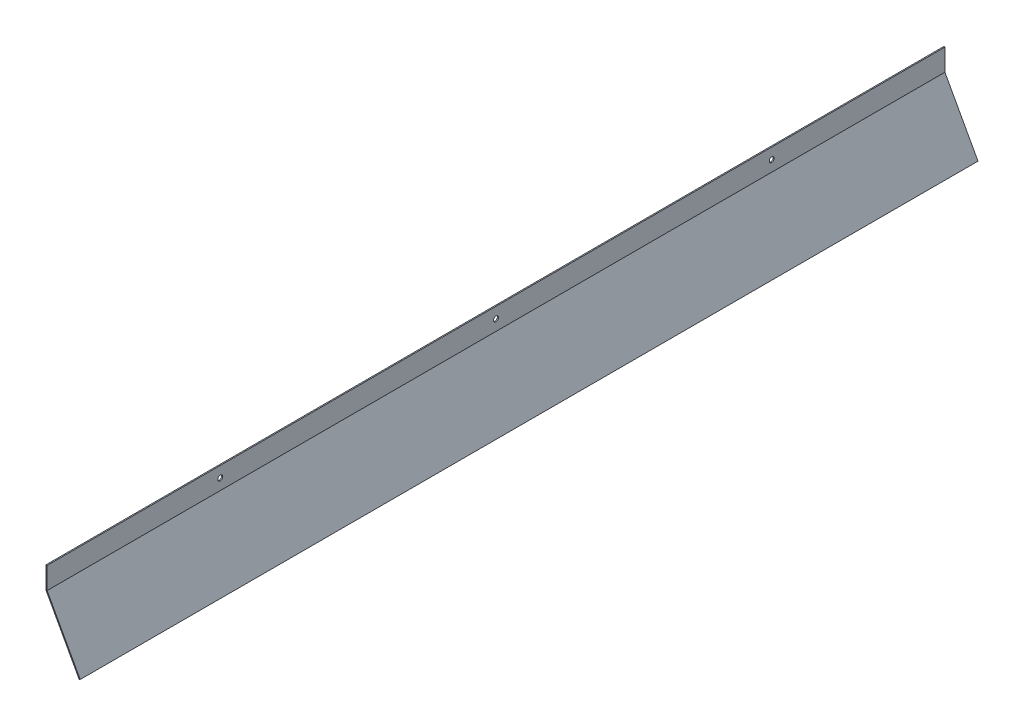
ISO-10303-21;
HEADER;
FILE_DESCRIPTION(('STEP AP214'),'2;1');
FILE_NAME('part.step','',(''),(''),'','','');
FILE_SCHEMA(('AUTOMOTIVE_DESIGN { 1 0 10303 214 1 1 1 1 }'));
ENDSEC;
DATA;
#1=APPLICATION_CONTEXT('core data for automotive mechanical design processes');
#2=APPLICATION_PROTOCOL_DEFINITION('international standard','automotive_design',2000,#1);
#3=PRODUCT_CONTEXT('',#1,'mechanical');
#4=PRODUCT('Part','Part','',(#3));
#5=PRODUCT_RELATED_PRODUCT_CATEGORY('part','',(#4));
#6=PRODUCT_DEFINITION_FORMATION('','',#4);
#7=PRODUCT_DEFINITION_CONTEXT('part definition',#1,'design');
#8=PRODUCT_DEFINITION('design','',#6,#7);
#9=PRODUCT_DEFINITION_SHAPE('','',#8);
#10=(LENGTH_UNIT() NAMED_UNIT(*) SI_UNIT(.MILLI.,.METRE.));
#11=(NAMED_UNIT(*) PLANE_ANGLE_UNIT() SI_UNIT($,.RADIAN.));
#12=(NAMED_UNIT(*) SI_UNIT($,.STERADIAN.) SOLID_ANGLE_UNIT());
#13=UNCERTAINTY_MEASURE_WITH_UNIT(LENGTH_MEASURE(1.E-05),#10,'distance_accuracy_value','');
#14=(GEOMETRIC_REPRESENTATION_CONTEXT(3) GLOBAL_UNCERTAINTY_ASSIGNED_CONTEXT((#13)) GLOBAL_UNIT_ASSIGNED_CONTEXT((#10,
#11,#12)) REPRESENTATION_CONTEXT('',''));
#15=CARTESIAN_POINT('',(0.,0.,0.));
#16=DIRECTION('',(0.,0.,1.));
#17=DIRECTION('',(1.,0.,0.));
#18=AXIS2_PLACEMENT_3D('',#15,#16,#17);
#19=CARTESIAN_POINT('',(0.,0.,-1628.));
#20=DIRECTION('',(1.,0.,0.));
#21=DIRECTION('',(0.,0.,-1.));
#22=AXIS2_PLACEMENT_3D('',#19,#20,#21);
#23=PLANE('',#22);
#24=CARTESIAN_POINT('',(0.,19.7443093499552,-314.));
#25=DIRECTION('',(1.,0.,0.));
#26=DIRECTION('',(0.,0.,-1.));
#27=AXIS2_PLACEMENT_3D('',#24,#25,#26);
#28=CIRCLE('',#27,4.4999999999999);
#29=CARTESIAN_POINT('',(0.,19.7443093499552,-318.5));
#30=VERTEX_POINT('',#29);
#31=EDGE_CURVE('E189',#30,#30,#28,.T.);
#32=ORIENTED_EDGE('',*,*,#31,.F.);
#33=EDGE_LOOP('',(#32));
#34=FACE_BOUND('',#33,.T.);
#35=CARTESIAN_POINT('',(0.,19.7443093499553,-1314.));
#36=DIRECTION('',(1.,0.,0.));
#37=DIRECTION('',(0.,0.,1.));
#38=AXIS2_PLACEMENT_3D('',#35,#36,#37);
#39=CIRCLE('',#38,4.50000000000001);
#40=CARTESIAN_POINT('',(0.,19.7443093499553,-1309.5));
#41=VERTEX_POINT('',#40);
#42=EDGE_CURVE('E195',#41,#41,#39,.T.);
#43=ORIENTED_EDGE('',*,*,#42,.F.);
#44=EDGE_LOOP('',(#43));
#45=FACE_BOUND('',#44,.T.);
#46=CARTESIAN_POINT('',(0.,19.7443093499552,-814.));
#47=DIRECTION('',(1.,0.,0.));
#48=DIRECTION('',(0.,0.,-1.));
#49=AXIS2_PLACEMENT_3D('',#46,#47,#48);
#50=CIRCLE('',#49,4.49999999999991);
#51=CARTESIAN_POINT('',(0.,19.7443093499552,-818.5));
#52=VERTEX_POINT('',#51);
#53=EDGE_CURVE('E192',#52,#52,#50,.T.);
#54=ORIENTED_EDGE('',*,*,#53,.F.);
#55=EDGE_LOOP('',(#54));
#56=FACE_BOUND('',#55,.T.);
#57=DIRECTION('',(0.,1.,0.));
#58=VECTOR('',#57,1.);
#59=CARTESIAN_POINT('',(0.,0.,0.));
#60=LINE('',#59,#58);
#61=CARTESIAN_POINT('',(0.,0.,0.));
#62=VERTEX_POINT('',#61);
#63=CARTESIAN_POINT('',(0.,39.4886186999102,0.));
#64=VERTEX_POINT('',#63);
#65=EDGE_CURVE('E122',#62,#64,#60,.T.);
#66=ORIENTED_EDGE('',*,*,#65,.F.);
#67=DIRECTION('',(0.,0.,1.));
#68=VECTOR('',#67,1.);
#69=CARTESIAN_POINT('',(0.,0.,-1628.));
#70=LINE('',#69,#68);
#71=CARTESIAN_POINT('',(0.,0.,-1628.));
#72=VERTEX_POINT('',#71);
#73=EDGE_CURVE('E11',#72,#62,#70,.T.);
#74=ORIENTED_EDGE('',*,*,#73,.F.);
#75=DIRECTION('',(0.,1.,0.));
#76=VECTOR('',#75,1.);
#77=CARTESIAN_POINT('',(0.,0.,-1628.));
#78=LINE('',#77,#76);
#79=CARTESIAN_POINT('',(0.,39.4886186999102,-1628.));
#80=VERTEX_POINT('',#79);
#81=EDGE_CURVE('E137',#72,#80,#78,.T.);
#82=ORIENTED_EDGE('',*,*,#81,.T.);
#83=DIRECTION('',(0.,0.,1.));
#84=VECTOR('',#83,1.);
#85=CARTESIAN_POINT('',(0.,39.4886186999102,-1628.));
#86=LINE('',#85,#84);
#87=EDGE_CURVE('E40',#80,#64,#86,.T.);
#88=ORIENTED_EDGE('',*,*,#87,.T.);
#89=EDGE_LOOP('',(#66,#74,#82,#88));
#90=FACE_BOUND('',#89,.T.);
#91=ADVANCED_FACE('F37',(#34,#45,#56,#90),#23,.T.);
#92=CARTESIAN_POINT('',(0.,0.,-1628.));
#93=DIRECTION('',(0.877268487978452,0.48,0.));
#94=DIRECTION('',(-0.48,0.877268487978452,0.));
#95=AXIS2_PLACEMENT_3D('',#92,#93,#94);
#96=PLANE('',#95);
#97=DIRECTION('',(-0.48,0.877268487978452,0.));
#98=VECTOR('',#97,1.);
#99=CARTESIAN_POINT('',(0.,0.,0.));
#100=LINE('',#99,#98);
#101=CARTESIAN_POINT('',(60.,-109.658560997307,0.));
#102=VERTEX_POINT('',#101);
#103=EDGE_CURVE('E135',#102,#62,#100,.T.);
#104=ORIENTED_EDGE('',*,*,#103,.F.);
#105=DIRECTION('',(0.,0.,1.));
#106=VECTOR('',#105,1.);
#107=CARTESIAN_POINT('',(60.,-109.658560997307,-1628.));
#108=LINE('',#107,#106);
#109=CARTESIAN_POINT('',(60.,-109.658560997307,-1628.));
#110=VERTEX_POINT('',#109);
#111=EDGE_CURVE('E46',#110,#102,#108,.T.);
#112=ORIENTED_EDGE('',*,*,#111,.F.);
#113=DIRECTION('',(-0.48,0.877268487978452,0.));
#114=VECTOR('',#113,1.);
#115=CARTESIAN_POINT('',(0.,0.,-1628.));
#116=LINE('',#115,#114);
#117=EDGE_CURVE('E112',#110,#72,#116,.T.);
#118=ORIENTED_EDGE('',*,*,#117,.T.);
#119=ORIENTED_EDGE('',*,*,#73,.T.);
#120=EDGE_LOOP('',(#104,#112,#118,#119));
#121=FACE_BOUND('',#120,.T.);
#122=ADVANCED_FACE('F145',(#121),#96,.T.);
#123=CARTESIAN_POINT('',(58.2454630240431,-110.618560997307,-1628.));
#124=DIRECTION('',(0.480000000000009,-0.877268487978447,0.));
#125=DIRECTION('',(0.877268487978448,0.480000000000009,0.));
#126=AXIS2_PLACEMENT_3D('',#123,#124,#125);
#127=PLANE('',#126);
#128=DIRECTION('',(0.877268487978448,0.480000000000009,0.));
#129=VECTOR('',#128,1.);
#130=CARTESIAN_POINT('',(58.2454630240431,-110.618560997307,0.));
#131=LINE('',#130,#129);
#132=CARTESIAN_POINT('',(58.2454630240431,-110.618560997307,0.));
#133=VERTEX_POINT('',#132);
#134=EDGE_CURVE('E99',#133,#102,#131,.T.);
#135=ORIENTED_EDGE('',*,*,#134,.F.);
#136=DIRECTION('',(0.,0.,1.));
#137=VECTOR('',#136,1.);
#138=CARTESIAN_POINT('',(58.2454630240431,-110.618560997307,-1628.));
#139=LINE('',#138,#137);
#140=CARTESIAN_POINT('',(58.2454630240431,-110.618560997307,-1628.));
#141=VERTEX_POINT('',#140);
#142=EDGE_CURVE('E94',#141,#133,#139,.T.);
#143=ORIENTED_EDGE('',*,*,#142,.F.);
#144=DIRECTION('',(0.877268487978448,0.480000000000009,0.));
#145=VECTOR('',#144,1.);
#146=CARTESIAN_POINT('',(58.2454630240431,-110.618560997307,-1628.));
#147=LINE('',#146,#145);
#148=EDGE_CURVE('E97',#141,#110,#147,.T.);
#149=ORIENTED_EDGE('',*,*,#148,.T.);
#150=ORIENTED_EDGE('',*,*,#111,.T.);
#151=EDGE_LOOP('',(#135,#143,#149,#150));
#152=FACE_BOUND('',#151,.T.);
#153=ADVANCED_FACE('F96',(#152),#127,.T.);
#154=CARTESIAN_POINT('',(-2.,-0.511381300089771,-1628.));
#155=DIRECTION('',(-0.877268487978452,-0.48,0.));
#156=DIRECTION('',(0.48,-0.877268487978452,0.));
#157=AXIS2_PLACEMENT_3D('',#154,#155,#156);
#158=PLANE('',#157);
#159=DIRECTION('',(0.48,-0.877268487978452,0.));
#160=VECTOR('',#159,1.);
#161=CARTESIAN_POINT('',(-2.,-0.511381300089771,0.));
#162=LINE('',#161,#160);
#163=CARTESIAN_POINT('',(-2.,-0.511381300089771,0.));
#164=VERTEX_POINT('',#163);
#165=EDGE_CURVE('E132',#164,#133,#162,.T.);
#166=ORIENTED_EDGE('',*,*,#165,.F.);
#167=DIRECTION('',(0.,0.,1.));
#168=VECTOR('',#167,1.);
#169=CARTESIAN_POINT('',(-2.,-0.511381300089771,-1628.));
#170=LINE('',#169,#168);
#171=CARTESIAN_POINT('',(-2.,-0.511381300089771,-1628.));
#172=VERTEX_POINT('',#171);
#173=EDGE_CURVE('E104',#172,#164,#170,.T.);
#174=ORIENTED_EDGE('',*,*,#173,.F.);
#175=DIRECTION('',(0.48,-0.877268487978452,0.));
#176=VECTOR('',#175,1.);
#177=CARTESIAN_POINT('',(-2.,-0.511381300089771,-1628.));
#178=LINE('',#177,#176);
#179=EDGE_CURVE('E110',#172,#141,#178,.T.);
#180=ORIENTED_EDGE('',*,*,#179,.T.);
#181=ORIENTED_EDGE('',*,*,#142,.T.);
#182=EDGE_LOOP('',(#166,#174,#180,#181));
#183=FACE_BOUND('',#182,.T.);
#184=ADVANCED_FACE('F114',(#183),#158,.T.);
#185=CARTESIAN_POINT('',(-2.,-0.511381300089771,-1628.));
#186=DIRECTION('',(-1.,0.,0.));
#187=DIRECTION('',(0.,0.,1.));
#188=AXIS2_PLACEMENT_3D('',#185,#186,#187);
#189=PLANE('',#188);
#190=CARTESIAN_POINT('',(-2.,19.7443093499552,-314.));
#191=DIRECTION('',(1.,0.,0.));
#192=DIRECTION('',(0.,0.,-1.));
#193=AXIS2_PLACEMENT_3D('',#190,#191,#192);
#194=CIRCLE('',#193,4.4999999999999);
#195=CARTESIAN_POINT('',(-2.,19.7443093499552,-318.5));
#196=VERTEX_POINT('',#195);
#197=EDGE_CURVE('E186',#196,#196,#194,.T.);
#198=ORIENTED_EDGE('',*,*,#197,.T.);
#199=EDGE_LOOP('',(#198));
#200=FACE_BOUND('',#199,.T.);
#201=CARTESIAN_POINT('',(-2.,19.7443093499553,-1314.));
#202=DIRECTION('',(1.,0.,0.));
#203=DIRECTION('',(0.,0.,1.));
#204=AXIS2_PLACEMENT_3D('',#201,#202,#203);
#205=CIRCLE('',#204,4.50000000000001);
#206=CARTESIAN_POINT('',(-2.,19.7443093499553,-1309.5));
#207=VERTEX_POINT('',#206);
#208=EDGE_CURVE('E190',#207,#207,#205,.T.);
#209=ORIENTED_EDGE('',*,*,#208,.T.);
#210=EDGE_LOOP('',(#209));
#211=FACE_BOUND('',#210,.T.);
#212=CARTESIAN_POINT('',(-2.,19.7443093499552,-814.));
#213=DIRECTION('',(1.,0.,0.));
#214=DIRECTION('',(0.,0.,-1.));
#215=AXIS2_PLACEMENT_3D('',#212,#213,#214);
#216=CIRCLE('',#215,4.49999999999991);
#217=CARTESIAN_POINT('',(-2.,19.7443093499552,-818.5));
#218=VERTEX_POINT('',#217);
#219=EDGE_CURVE('E126',#218,#218,#216,.T.);
#220=ORIENTED_EDGE('',*,*,#219,.T.);
#221=EDGE_LOOP('',(#220));
#222=FACE_BOUND('',#221,.T.);
#223=DIRECTION('',(0.,-1.,0.));
#224=VECTOR('',#223,1.);
#225=CARTESIAN_POINT('',(-2.,-0.511381300089771,0.));
#226=LINE('',#225,#224);
#227=CARTESIAN_POINT('',(-2.,39.4886186999102,0.));
#228=VERTEX_POINT('',#227);
#229=EDGE_CURVE('E129',#228,#164,#226,.T.);
#230=ORIENTED_EDGE('',*,*,#229,.F.);
#231=DIRECTION('',(0.,0.,1.));
#232=VECTOR('',#231,1.);
#233=CARTESIAN_POINT('',(-2.,39.4886186999102,-1628.));
#234=LINE('',#233,#232);
#235=CARTESIAN_POINT('',(-2.,39.4886186999102,-1628.));
#236=VERTEX_POINT('',#235);
#237=EDGE_CURVE('E140',#236,#228,#234,.T.);
#238=ORIENTED_EDGE('',*,*,#237,.F.);
#239=DIRECTION('',(0.,-1.,0.));
#240=VECTOR('',#239,1.);
#241=CARTESIAN_POINT('',(-2.,-0.511381300089771,-1628.));
#242=LINE('',#241,#240);
#243=EDGE_CURVE('E115',#236,#172,#242,.T.);
#244=ORIENTED_EDGE('',*,*,#243,.T.);
#245=ORIENTED_EDGE('',*,*,#173,.T.);
#246=EDGE_LOOP('',(#230,#238,#244,#245));
#247=FACE_BOUND('',#246,.T.);
#248=ADVANCED_FACE('F159',(#200,#211,#222,#247),#189,.T.);
#249=CARTESIAN_POINT('',(0.,39.4886186999102,-1628.));
#250=DIRECTION('',(0.,1.,0.));
#251=DIRECTION('',(-1.,0.,0.));
#252=AXIS2_PLACEMENT_3D('',#249,#250,#251);
#253=PLANE('',#252);
#254=DIRECTION('',(-1.,0.,0.));
#255=VECTOR('',#254,1.);
#256=CARTESIAN_POINT('',(0.,39.4886186999102,0.));
#257=LINE('',#256,#255);
#258=EDGE_CURVE('E125',#64,#228,#257,.T.);
#259=ORIENTED_EDGE('',*,*,#258,.F.);
#260=ORIENTED_EDGE('',*,*,#87,.F.);
#261=DIRECTION('',(-1.,0.,0.));
#262=VECTOR('',#261,1.);
#263=CARTESIAN_POINT('',(0.,39.4886186999102,-1628.));
#264=LINE('',#263,#262);
#265=EDGE_CURVE('E117',#80,#236,#264,.T.);
#266=ORIENTED_EDGE('',*,*,#265,.T.);
#267=ORIENTED_EDGE('',*,*,#237,.T.);
#268=EDGE_LOOP('',(#259,#260,#266,#267));
#269=FACE_BOUND('',#268,.T.);
#270=ADVANCED_FACE('F142',(#269),#253,.T.);
#271=CARTESIAN_POINT('',(0.,0.,-1628.));
#272=DIRECTION('',(0.,0.,1.));
#273=DIRECTION('',(1.,0.,0.));
#274=AXIS2_PLACEMENT_3D('',#271,#272,#273);
#275=PLANE('',#274);
#276=ORIENTED_EDGE('',*,*,#81,.F.);
#277=ORIENTED_EDGE('',*,*,#117,.F.);
#278=ORIENTED_EDGE('',*,*,#148,.F.);
#279=ORIENTED_EDGE('',*,*,#179,.F.);
#280=ORIENTED_EDGE('',*,*,#243,.F.);
#281=ORIENTED_EDGE('',*,*,#265,.F.);
#282=EDGE_LOOP('',(#276,#277,#278,#279,#280,#281));
#283=FACE_BOUND('',#282,.T.);
#284=ADVANCED_FACE('F108',(#283),#275,.F.);
#285=CARTESIAN_POINT('',(0.,0.,0.));
#286=DIRECTION('',(0.,0.,1.));
#287=DIRECTION('',(1.,0.,0.));
#288=AXIS2_PLACEMENT_3D('',#285,#286,#287);
#289=PLANE('',#288);
#290=ORIENTED_EDGE('',*,*,#65,.T.);
#291=ORIENTED_EDGE('',*,*,#258,.T.);
#292=ORIENTED_EDGE('',*,*,#229,.T.);
#293=ORIENTED_EDGE('',*,*,#165,.T.);
#294=ORIENTED_EDGE('',*,*,#134,.T.);
#295=ORIENTED_EDGE('',*,*,#103,.T.);
#296=EDGE_LOOP('',(#290,#291,#292,#293,#294,#295));
#297=FACE_BOUND('',#296,.T.);
#298=ADVANCED_FACE('F144',(#297),#289,.T.);
#299=CARTESIAN_POINT('',(-2.,19.7443093499552,-814.));
#300=DIRECTION('',(1.,0.,0.));
#301=DIRECTION('',(0.,0.,-1.));
#302=AXIS2_PLACEMENT_3D('',#299,#300,#301);
#303=CYLINDRICAL_SURFACE('',#302,4.49999999999991);
#304=ORIENTED_EDGE('',*,*,#219,.F.);
#305=EDGE_LOOP('',(#304));
#306=FACE_BOUND('',#305,.T.);
#307=ORIENTED_EDGE('',*,*,#53,.T.);
#308=EDGE_LOOP('',(#307));
#309=FACE_BOUND('',#308,.T.);
#310=ADVANCED_FACE('F169',(#306,#309),#303,.F.);
#311=CARTESIAN_POINT('',(-2.,19.7443093499553,-1314.));
#312=DIRECTION('',(1.,0.,0.));
#313=DIRECTION('',(0.,0.,-1.));
#314=AXIS2_PLACEMENT_3D('',#311,#312,#313);
#315=CYLINDRICAL_SURFACE('',#314,4.50000000000001);
#316=ORIENTED_EDGE('',*,*,#208,.F.);
#317=EDGE_LOOP('',(#316));
#318=FACE_BOUND('',#317,.T.);
#319=ORIENTED_EDGE('',*,*,#42,.T.);
#320=EDGE_LOOP('',(#319));
#321=FACE_BOUND('',#320,.T.);
#322=ADVANCED_FACE('F173',(#318,#321),#315,.F.);
#323=CARTESIAN_POINT('',(-2.,19.7443093499552,-314.));
#324=DIRECTION('',(1.,0.,0.));
#325=DIRECTION('',(0.,0.,-1.));
#326=AXIS2_PLACEMENT_3D('',#323,#324,#325);
#327=CYLINDRICAL_SURFACE('',#326,4.4999999999999);
#328=ORIENTED_EDGE('',*,*,#197,.F.);
#329=EDGE_LOOP('',(#328));
#330=FACE_BOUND('',#329,.T.);
#331=ORIENTED_EDGE('',*,*,#31,.T.);
#332=EDGE_LOOP('',(#331));
#333=FACE_BOUND('',#332,.T.);
#334=ADVANCED_FACE('F177',(#330,#333),#327,.F.);
#335=CLOSED_SHELL('',(#91,#122,#153,#184,#248,#270,#284,#298,#310,#322,#334));
#336=MANIFOLD_SOLID_BREP('B2',#335);
#337=ADVANCED_BREP_SHAPE_REPRESENTATION('',(#18,#336),#14);
#338=SHAPE_DEFINITION_REPRESENTATION(#9,#337);
ENDSEC;
END-ISO-10303-21;
